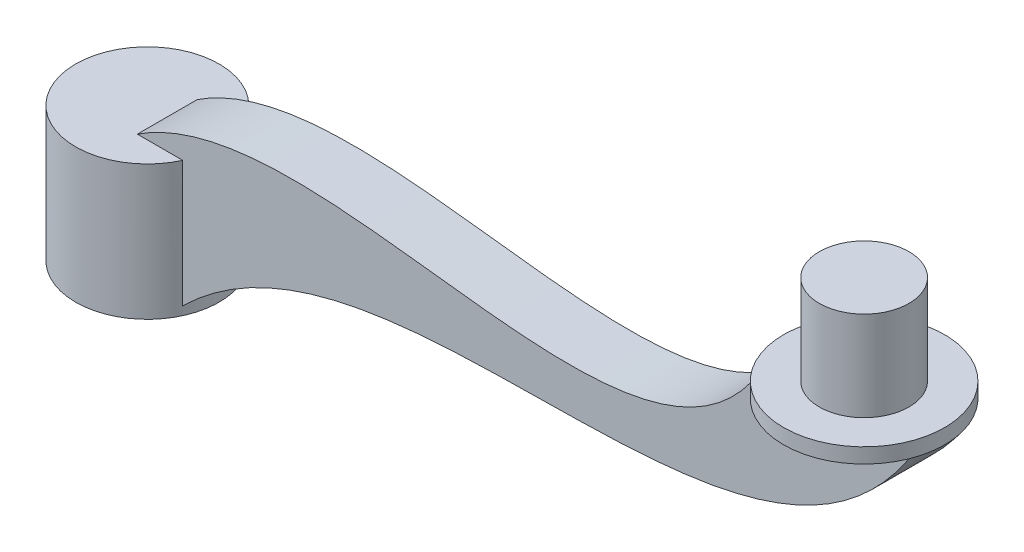
ISO-10303-21;
HEADER;
FILE_DESCRIPTION(('STEP AP214'),'2;1');
FILE_NAME('part.step','',(''),(''),'','','');
FILE_SCHEMA(('AUTOMOTIVE_DESIGN { 1 0 10303 214 1 1 1 1 }'));
ENDSEC;
DATA;
#1=APPLICATION_CONTEXT('core data for automotive mechanical design processes');
#2=APPLICATION_PROTOCOL_DEFINITION('international standard','automotive_design',2000,#1);
#3=PRODUCT_CONTEXT('',#1,'mechanical');
#4=PRODUCT('Part','Part','',(#3));
#5=PRODUCT_RELATED_PRODUCT_CATEGORY('part','',(#4));
#6=PRODUCT_DEFINITION_FORMATION('','',#4);
#7=PRODUCT_DEFINITION_CONTEXT('part definition',#1,'design');
#8=PRODUCT_DEFINITION('design','',#6,#7);
#9=PRODUCT_DEFINITION_SHAPE('','',#8);
#10=(LENGTH_UNIT() NAMED_UNIT(*) SI_UNIT(.MILLI.,.METRE.));
#11=(NAMED_UNIT(*) PLANE_ANGLE_UNIT() SI_UNIT($,.RADIAN.));
#12=(NAMED_UNIT(*) SI_UNIT($,.STERADIAN.) SOLID_ANGLE_UNIT());
#13=UNCERTAINTY_MEASURE_WITH_UNIT(LENGTH_MEASURE(1.E-05),#10,'distance_accuracy_value','');
#14=(GEOMETRIC_REPRESENTATION_CONTEXT(3) GLOBAL_UNCERTAINTY_ASSIGNED_CONTEXT((#13)) GLOBAL_UNIT_ASSIGNED_CONTEXT((#10,
#11,#12)) REPRESENTATION_CONTEXT('',''));
#15=CARTESIAN_POINT('',(0.,0.,0.));
#16=DIRECTION('',(0.,0.,1.));
#17=DIRECTION('',(1.,0.,0.));
#18=AXIS2_PLACEMENT_3D('',#15,#16,#17);
#19=CARTESIAN_POINT('',(56.7945984748159,34.1145483571935,5.));
#20=DIRECTION('',(0.,0.,1.));
#21=DIRECTION('',(1.,0.,0.));
#22=AXIS2_PLACEMENT_3D('',#19,#20,#21);
#23=PLANE('',#22);
#24=DIRECTION('',(-1.,0.,0.));
#25=VECTOR('',#24,1.);
#26=CARTESIAN_POINT('',(56.7945984748159,30.,5.));
#27=LINE('',#26,#25);
#28=CARTESIAN_POINT('',(10.9087121146357,30.,5.));
#29=VERTEX_POINT('',#28);
#30=CARTESIAN_POINT('',(3.32301425381185,30.0000000064752,5.));
#31=VERTEX_POINT('',#30);
#32=EDGE_CURVE('E204',#29,#31,#27,.T.);
#33=ORIENTED_EDGE('',*,*,#32,.F.);
#34=DIRECTION('',(0.,-1.,0.));
#35=VECTOR('',#34,1.);
#36=CARTESIAN_POINT('',(10.9087121146357,27.5,5.));
#37=LINE('',#36,#35);
#38=CARTESIAN_POINT('',(10.9087121243852,8.93672570436775,5.));
#39=VERTEX_POINT('',#38);
#40=EDGE_CURVE('E54',#39,#29,#37,.F.);
#41=ORIENTED_EDGE('',*,*,#40,.F.);
#42=CARTESIAN_POINT('',(8.96130530046107,6.91526062901725,5.));
#43=CARTESIAN_POINT('',(42.430030166571,43.6238022144115,5.));
#44=CARTESIAN_POINT('',(104.826512854306,5.89325619487997,5.));
#45=CARTESIAN_POINT('',(132.347009744007,47.5,5.));
#46=B_SPLINE_CURVE_WITH_KNOTS('',3,(#42,#43,#44,#45),.UNSPECIFIED.,.F.,.F.,(4,4),(0.,1.),.UNSPECIFIED.);
#47=CARTESIAN_POINT('',(132.347009744007,47.5,4.99999999999998));
#48=VERTEX_POINT('',#47);
#49=EDGE_CURVE('E135',#39,#48,#46,.T.);
#50=ORIENTED_EDGE('',*,*,#49,.T.);
#51=DIRECTION('',(-1.,0.,0.));
#52=VECTOR('',#51,1.);
#53=CARTESIAN_POINT('',(107.347009744007,47.5,5.));
#54=LINE('',#53,#52);
#55=CARTESIAN_POINT('',(107.347009744007,47.5,4.99999999999999));
#56=VERTEX_POINT('',#55);
#57=EDGE_CURVE('E107',#48,#56,#54,.T.);
#58=ORIENTED_EDGE('',*,*,#57,.T.);
#59=CARTESIAN_POINT('',(107.347009744007,47.5,5.));
#60=CARTESIAN_POINT('',(86.574153169107,13.5320115786208,5.));
#61=CARTESIAN_POINT('',(29.0957728490664,52.4401173738952,5.));
#62=CARTESIAN_POINT('',(0.,27.5,5.));
#63=B_SPLINE_CURVE_WITH_KNOTS('',3,(#59,#60,#61,#62),.UNSPECIFIED.,.F.,.F.,(4,4),(0.,1.),.UNSPECIFIED.);
#64=EDGE_CURVE('E218',#56,#31,#63,.T.);
#65=ORIENTED_EDGE('',*,*,#64,.T.);
#66=EDGE_LOOP('',(#33,#41,#50,#58,#65));
#67=FACE_BOUND('',#66,.T.);
#68=ADVANCED_FACE('F37',(#67),#23,.T.);
#69=CARTESIAN_POINT('',(56.7945984748159,34.1145483571935,-5.));
#70=DIRECTION('',(0.,0.,1.));
#71=DIRECTION('',(1.,0.,0.));
#72=AXIS2_PLACEMENT_3D('',#69,#70,#71);
#73=PLANE('',#72);
#74=DIRECTION('',(0.,-1.,0.));
#75=VECTOR('',#74,1.);
#76=CARTESIAN_POINT('',(10.9087121146357,27.5,-5.));
#77=LINE('',#76,#75);
#78=CARTESIAN_POINT('',(10.9087121243852,8.93672570436775,-5.));
#79=VERTEX_POINT('',#78);
#80=CARTESIAN_POINT('',(10.9087121146357,30.,-5.));
#81=VERTEX_POINT('',#80);
#82=EDGE_CURVE('E146',#79,#81,#77,.F.);
#83=ORIENTED_EDGE('',*,*,#82,.T.);
#84=DIRECTION('',(-1.,0.,0.));
#85=VECTOR('',#84,1.);
#86=CARTESIAN_POINT('',(56.7945984748159,30.,-5.));
#87=LINE('',#86,#85);
#88=CARTESIAN_POINT('',(3.32301425381185,30.0000000064752,-5.));
#89=VERTEX_POINT('',#88);
#90=EDGE_CURVE('E42',#81,#89,#87,.T.);
#91=ORIENTED_EDGE('',*,*,#90,.T.);
#92=CARTESIAN_POINT('',(107.347009744007,47.5,-5.));
#93=CARTESIAN_POINT('',(86.574153169107,13.5320115786208,-5.));
#94=CARTESIAN_POINT('',(29.0957728490664,52.4401173738952,-5.));
#95=CARTESIAN_POINT('',(0.,27.5,-5.));
#96=B_SPLINE_CURVE_WITH_KNOTS('',3,(#92,#93,#94,#95),.UNSPECIFIED.,.F.,.F.,(4,4),(0.,1.),.UNSPECIFIED.);
#97=CARTESIAN_POINT('',(107.347009744007,47.5,-5.));
#98=VERTEX_POINT('',#97);
#99=EDGE_CURVE('E199',#98,#89,#96,.T.);
#100=ORIENTED_EDGE('',*,*,#99,.F.);
#101=DIRECTION('',(-1.,0.,0.));
#102=VECTOR('',#101,1.);
#103=CARTESIAN_POINT('',(107.347009744007,47.5,-5.));
#104=LINE('',#103,#102);
#105=CARTESIAN_POINT('',(132.347009744007,47.5,-4.99999999999998));
#106=VERTEX_POINT('',#105);
#107=EDGE_CURVE('E213',#106,#98,#104,.T.);
#108=ORIENTED_EDGE('',*,*,#107,.F.);
#109=CARTESIAN_POINT('',(8.96130530046107,6.91526062901725,-5.));
#110=CARTESIAN_POINT('',(42.430030166571,43.6238022144115,-5.));
#111=CARTESIAN_POINT('',(104.826512854306,5.89325619487997,-5.));
#112=CARTESIAN_POINT('',(132.347009744007,47.5,-5.));
#113=B_SPLINE_CURVE_WITH_KNOTS('',3,(#109,#110,#111,#112),.UNSPECIFIED.,.F.,.F.,(4,4),(0.,1.),.UNSPECIFIED.);
#114=EDGE_CURVE('E141',#79,#106,#113,.T.);
#115=ORIENTED_EDGE('',*,*,#114,.F.);
#116=EDGE_LOOP('',(#83,#91,#100,#108,#115));
#117=FACE_BOUND('',#116,.T.);
#118=ADVANCED_FACE('F186',(#117),#73,.F.);
#119=DIRECTION('',(0.,0.,-1.));
#120=VECTOR('',#119,1.);
#121=SURFACE_OF_LINEAR_EXTRUSION('',#46,#120);
#122=ORIENTED_EDGE('',*,*,#49,.F.);
#123=CARTESIAN_POINT('',(10.9087121146357,8.93672569479504,5.));
#124=CARTESIAN_POINT('',(10.9750924873974,9.00190220388737,4.85518919719385));
#125=CARTESIAN_POINT('',(11.0390515291262,9.06433743322561,4.70802027712108));
#126=CARTESIAN_POINT('',(11.161772463274,9.1835449869188,4.40918401146909));
#127=CARTESIAN_POINT('',(11.2205315253605,9.24031422941745,4.25751427535224));
#128=CARTESIAN_POINT('',(11.3324333877793,9.34794621351776,3.95002942770915));
#129=CARTESIAN_POINT('',(11.3855753799982,9.39880810534778,3.79421372373853));
#130=CARTESIAN_POINT('',(11.4859525211913,9.49449997028225,3.47855820555797));
#131=CARTESIAN_POINT('',(11.5331776457461,9.53931971622271,3.31871209885348));
#132=CARTESIAN_POINT('',(11.6212702927884,9.62264024102565,2.99567945256046));
#133=CARTESIAN_POINT('',(11.6621388464231,9.661142044825,2.8324934596302));
#134=CARTESIAN_POINT('',(11.7372199519066,9.73167288072524,2.50323590255211));
#135=CARTESIAN_POINT('',(11.7714328647516,9.76370226388831,2.33716449543918));
#136=CARTESIAN_POINT('',(11.8484640117175,9.83565449841943,1.91816176132851));
#137=CARTESIAN_POINT('',(11.8869145633315,9.87140635828938,1.66368184047784));
#138=CARTESIAN_POINT('',(11.9474504580324,9.92758989348723,1.15110838815624));
#139=CARTESIAN_POINT('',(11.9695347394631,9.94802057495361,0.893014623366806));
#140=CARTESIAN_POINT('',(11.9969169765397,9.97334118452013,0.375524810011332));
#141=CARTESIAN_POINT('',(12.0022378066459,9.97825228978664,0.116131020222214));
#142=CARTESIAN_POINT('',(11.9960564130363,9.97254139387251,-0.402268305286472));
#143=CARTESIAN_POINT('',(11.9845552923721,9.96192041116447,-0.661273865348341));
#144=CARTESIAN_POINT('',(11.9457045452131,9.92595772202473,-1.16704801358765));
#145=CARTESIAN_POINT('',(11.9189771506314,9.90119387931852,-1.41390608652221));
#146=CARTESIAN_POINT('',(11.8506106054289,9.83762826894151,-1.90372829766149));
#147=CARTESIAN_POINT('',(11.8089706106376,9.79882570656738,-2.1466922146127));
#148=CARTESIAN_POINT('',(11.711446146265,9.7075193936419,-2.6271946285022));
#149=CARTESIAN_POINT('',(11.6555571055591,9.65501124618042,-2.86473135769171));
#150=CARTESIAN_POINT('',(11.5304395160974,9.53677520944826,-3.33281337071901));
#151=CARTESIAN_POINT('',(11.4612148679393,9.47105118550887,-3.56336067616218));
#152=CARTESIAN_POINT('',(11.3161054732223,9.33232910505702,-3.99931086703459));
#153=CARTESIAN_POINT('',(11.2411088295748,9.26024550136529,-4.20530319412733));
#154=CARTESIAN_POINT('',(11.081736049113,9.10596185132348,-4.60892372833974));
#155=CARTESIAN_POINT('',(10.9973891109575,9.02379321644615,-4.80657545283623));
#156=CARTESIAN_POINT('',(10.9087121146357,8.93672569479504,-5.));
#157=B_SPLINE_CURVE_WITH_KNOTS('',3,(#123,#124,#125,#126,#127,#128,#129,#130,#131,#132,#133,
#134,#135,#136,#137,#138,#139,#140,#141,#142,#143,#144,#145,#146,#147,#148,#149,#150,#151,#152,
#153,#154,#155,#156),.UNSPECIFIED.,.F.,.F.,(4,2,2,2,2,2,2,2,2,2,2,2,2,2,2,2,4),(0.,
0.516316274832384,1.03291187236282,1.54958169030603,2.06711534746016,2.58456496382459,
3.10198650633647,3.88047093407713,4.65900585654986,5.43647797302186,6.21389911125103,
6.96162108442629,7.70938539124293,8.45738988496947,9.20517592245298,9.89691281111184,
10.5865473885536),.UNSPECIFIED.);
#158=EDGE_CURVE('E171',#39,#79,#157,.T.);
#159=ORIENTED_EDGE('',*,*,#158,.T.);
#160=ORIENTED_EDGE('',*,*,#114,.T.);
#161=DIRECTION('',(0.,0.,-1.));
#162=VECTOR('',#161,1.);
#163=CARTESIAN_POINT('',(132.347009744007,47.5,5.));
#164=LINE('',#163,#162);
#165=EDGE_CURVE('E130',#48,#106,#164,.T.);
#166=ORIENTED_EDGE('',*,*,#165,.F.);
#167=EDGE_LOOP('',(#122,#159,#160,#166));
#168=FACE_BOUND('',#167,.T.);
#169=ADVANCED_FACE('F139',(#168),#121,.F.);
#170=CARTESIAN_POINT('',(0.,27.5,5.));
#171=DIRECTION('',(0.,1.,0.));
#172=DIRECTION('',(-1.,0.,0.));
#173=AXIS2_PLACEMENT_3D('',#170,#171,#172);
#174=PLANE('',#173);
#175=CARTESIAN_POINT('',(0.,27.5,0.));
#176=DIRECTION('',(0.,1.,0.));
#177=DIRECTION('',(0.,0.,1.));
#178=AXIS2_PLACEMENT_3D('',#175,#176,#177);
#179=CIRCLE('',#178,7.5005);
#180=CARTESIAN_POINT('',(0.,27.5,7.5005));
#181=VERTEX_POINT('',#180);
#182=EDGE_CURVE('E163',#181,#181,#179,.T.);
#183=ORIENTED_EDGE('',*,*,#182,.F.);
#184=EDGE_LOOP('',(#183));
#185=FACE_BOUND('',#184,.T.);
#186=ADVANCED_FACE('F234',(#185),#174,.F.);
#187=DIRECTION('',(0.,0.,-1.));
#188=VECTOR('',#187,1.);
#189=SURFACE_OF_LINEAR_EXTRUSION('',#63,#188);
#190=ORIENTED_EDGE('',*,*,#99,.T.);
#191=DIRECTION('',(0.,0.,-1.));
#192=VECTOR('',#191,1.);
#193=CARTESIAN_POINT('',(3.32301424395503,30.,5.));
#194=LINE('',#193,#192);
#195=EDGE_CURVE('E62',#89,#31,#194,.F.);
#196=ORIENTED_EDGE('',*,*,#195,.T.);
#197=ORIENTED_EDGE('',*,*,#64,.F.);
#198=DIRECTION('',(0.,0.,-1.));
#199=VECTOR('',#198,1.);
#200=CARTESIAN_POINT('',(107.347009744007,47.5,5.));
#201=LINE('',#200,#199);
#202=EDGE_CURVE('E114',#56,#98,#201,.T.);
#203=ORIENTED_EDGE('',*,*,#202,.T.);
#204=EDGE_LOOP('',(#190,#196,#197,#203));
#205=FACE_BOUND('',#204,.T.);
#206=ADVANCED_FACE('F230',(#205),#189,.F.);
#207=CARTESIAN_POINT('',(0.,7.5,0.));
#208=DIRECTION('',(0.,1.,0.));
#209=DIRECTION('',(0.,0.,1.));
#210=AXIS2_PLACEMENT_3D('',#207,#208,#209);
#211=PLANE('',#210);
#212=DIRECTION('',(0.,0.,-1.));
#213=VECTOR('',#212,1.);
#214=CARTESIAN_POINT('',(8.96130530046107,7.5,0.));
#215=LINE('',#214,#213);
#216=CARTESIAN_POINT('',(8.96130530046107,7.5,5.));
#217=VERTEX_POINT('',#216);
#218=CARTESIAN_POINT('',(8.96130530046107,7.5,-5.));
#219=VERTEX_POINT('',#218);
#220=EDGE_CURVE('E177',#217,#219,#215,.T.);
#221=ORIENTED_EDGE('',*,*,#220,.F.);
#222=DIRECTION('',(1.,0.,0.));
#223=VECTOR('',#222,1.);
#224=CARTESIAN_POINT('',(0.,7.5,5.));
#225=LINE('',#224,#223);
#226=CARTESIAN_POINT('',(9.50277291117378,7.5,5.));
#227=VERTEX_POINT('',#226);
#228=EDGE_CURVE('E157',#217,#227,#225,.T.);
#229=ORIENTED_EDGE('',*,*,#228,.T.);
#230=DIRECTION('',(0.,0.,-1.));
#231=VECTOR('',#230,1.);
#232=CARTESIAN_POINT('',(9.50277291117378,7.5,5.));
#233=LINE('',#232,#231);
#234=CARTESIAN_POINT('',(9.50277291117596,7.50000000000231,-5.));
#235=VERTEX_POINT('',#234);
#236=EDGE_CURVE('E159',#235,#227,#233,.F.);
#237=ORIENTED_EDGE('',*,*,#236,.F.);
#238=DIRECTION('',(1.,0.,0.));
#239=VECTOR('',#238,1.);
#240=CARTESIAN_POINT('',(0.,7.5,-5.));
#241=LINE('',#240,#239);
#242=EDGE_CURVE('E153',#219,#235,#241,.T.);
#243=ORIENTED_EDGE('',*,*,#242,.F.);
#244=EDGE_LOOP('',(#221,#229,#237,#243));
#245=FACE_BOUND('',#244,.T.);
#246=CARTESIAN_POINT('',(0.,7.5,0.));
#247=DIRECTION('',(0.,1.,0.));
#248=DIRECTION('',(0.,0.,1.));
#249=AXIS2_PLACEMENT_3D('',#246,#247,#248);
#250=CIRCLE('',#249,12.);
#251=CARTESIAN_POINT('',(0.,7.5,12.));
#252=VERTEX_POINT('',#251);
#253=EDGE_CURVE('E166',#252,#252,#250,.T.);
#254=ORIENTED_EDGE('',*,*,#253,.F.);
#255=EDGE_LOOP('',(#254));
#256=FACE_BOUND('',#255,.T.);
#257=CARTESIAN_POINT('',(0.,7.5,0.));
#258=DIRECTION('',(0.,1.,0.));
#259=DIRECTION('',(0.,0.,1.));
#260=AXIS2_PLACEMENT_3D('',#257,#258,#259);
#261=CIRCLE('',#260,7.5005);
#262=CARTESIAN_POINT('',(0.,7.5,7.5005));
#263=VERTEX_POINT('',#262);
#264=EDGE_CURVE('E162',#263,#263,#261,.T.);
#265=ORIENTED_EDGE('',*,*,#264,.T.);
#266=EDGE_LOOP('',(#265));
#267=FACE_BOUND('',#266,.T.);
#268=ADVANCED_FACE('F233',(#245,#256,#267),#211,.F.);
#269=CARTESIAN_POINT('',(0.,27.5,0.));
#270=DIRECTION('',(0.,-1.,0.));
#271=DIRECTION('',(0.,0.,-1.));
#272=AXIS2_PLACEMENT_3D('',#269,#270,#271);
#273=CYLINDRICAL_SURFACE('',#272,12.);
#274=ORIENTED_EDGE('',*,*,#158,.F.);
#275=ORIENTED_EDGE('',*,*,#40,.T.);
#276=CARTESIAN_POINT('',(0.,30.,0.));
#277=DIRECTION('',(0.,1.,0.));
#278=DIRECTION('',(0.,0.,1.));
#279=AXIS2_PLACEMENT_3D('',#276,#277,#278);
#280=CIRCLE('',#279,12.);
#281=EDGE_CURVE('E271',#81,#29,#280,.T.);
#282=ORIENTED_EDGE('',*,*,#281,.F.);
#283=ORIENTED_EDGE('',*,*,#82,.F.);
#284=EDGE_LOOP('',(#274,#275,#282,#283));
#285=FACE_BOUND('',#284,.T.);
#286=ORIENTED_EDGE('',*,*,#253,.T.);
#287=EDGE_LOOP('',(#286));
#288=FACE_BOUND('',#287,.T.);
#289=ADVANCED_FACE('F39',(#285,#288),#273,.T.);
#290=CARTESIAN_POINT('',(0.,27.5,0.));
#291=DIRECTION('',(0.,-1.,0.));
#292=DIRECTION('',(0.,0.,-1.));
#293=AXIS2_PLACEMENT_3D('',#290,#291,#292);
#294=CYLINDRICAL_SURFACE('',#293,7.5005);
#295=ORIENTED_EDGE('',*,*,#182,.T.);
#296=EDGE_LOOP('',(#295));
#297=FACE_BOUND('',#296,.T.);
#298=ORIENTED_EDGE('',*,*,#264,.F.);
#299=EDGE_LOOP('',(#298));
#300=FACE_BOUND('',#299,.T.);
#301=ADVANCED_FACE('F235',(#297,#300),#294,.F.);
#302=ORIENTED_EDGE('',*,*,#228,.F.);
#303=DIRECTION('',(0.,-1.,0.));
#304=VECTOR('',#303,1.);
#305=CARTESIAN_POINT('',(8.96130530046107,27.5,5.));
#306=LINE('',#305,#304);
#307=CARTESIAN_POINT('',(8.96130530046107,6.91526062901725,5.));
#308=VERTEX_POINT('',#307);
#309=EDGE_CURVE('E137',#217,#308,#306,.T.);
#310=ORIENTED_EDGE('',*,*,#309,.T.);
#311=EDGE_CURVE('E115',#308,#227,#46,.T.);
#312=ORIENTED_EDGE('',*,*,#311,.T.);
#313=EDGE_LOOP('',(#302,#310,#312));
#314=FACE_BOUND('',#313,.T.);
#315=ADVANCED_FACE('F237',(#314),#23,.T.);
#316=DIRECTION('',(0.,-1.,0.));
#317=VECTOR('',#316,1.);
#318=CARTESIAN_POINT('',(8.96130530046107,27.5,-5.));
#319=LINE('',#318,#317);
#320=CARTESIAN_POINT('',(8.96130530046107,6.91526062901725,-5.));
#321=VERTEX_POINT('',#320);
#322=EDGE_CURVE('E203',#219,#321,#319,.T.);
#323=ORIENTED_EDGE('',*,*,#322,.F.);
#324=ORIENTED_EDGE('',*,*,#242,.T.);
#325=EDGE_CURVE('E209',#321,#235,#113,.T.);
#326=ORIENTED_EDGE('',*,*,#325,.F.);
#327=EDGE_LOOP('',(#323,#324,#326));
#328=FACE_BOUND('',#327,.T.);
#329=ADVANCED_FACE('F184',(#328),#73,.F.);
#330=ORIENTED_EDGE('',*,*,#325,.T.);
#331=ORIENTED_EDGE('',*,*,#236,.T.);
#332=ORIENTED_EDGE('',*,*,#311,.F.);
#333=DIRECTION('',(0.,0.,-1.));
#334=VECTOR('',#333,1.);
#335=CARTESIAN_POINT('',(8.96130530046107,6.91526062901725,5.));
#336=LINE('',#335,#334);
#337=EDGE_CURVE('E143',#308,#321,#336,.T.);
#338=ORIENTED_EDGE('',*,*,#337,.T.);
#339=EDGE_LOOP('',(#330,#331,#332,#338));
#340=FACE_BOUND('',#339,.T.);
#341=ADVANCED_FACE('F178',(#340),#121,.F.);
#342=CARTESIAN_POINT('',(8.96130530046107,27.5,5.));
#343=DIRECTION('',(1.,0.,0.));
#344=DIRECTION('',(0.,1.,0.));
#345=AXIS2_PLACEMENT_3D('',#342,#343,#344);
#346=PLANE('',#345);
#347=ORIENTED_EDGE('',*,*,#309,.F.);
#348=ORIENTED_EDGE('',*,*,#220,.T.);
#349=ORIENTED_EDGE('',*,*,#322,.T.);
#350=ORIENTED_EDGE('',*,*,#337,.F.);
#351=EDGE_LOOP('',(#347,#348,#349,#350));
#352=FACE_BOUND('',#351,.T.);
#353=ADVANCED_FACE('F183',(#352),#346,.F.);
#354=CARTESIAN_POINT('',(0.,30.,0.));
#355=DIRECTION('',(0.,1.,0.));
#356=DIRECTION('',(0.,0.,1.));
#357=AXIS2_PLACEMENT_3D('',#354,#355,#356);
#358=PLANE('',#357);
#359=ORIENTED_EDGE('',*,*,#281,.T.);
#360=ORIENTED_EDGE('',*,*,#32,.T.);
#361=ORIENTED_EDGE('',*,*,#195,.F.);
#362=ORIENTED_EDGE('',*,*,#90,.F.);
#363=EDGE_LOOP('',(#359,#360,#361,#362));
#364=FACE_BOUND('',#363,.T.);
#365=ADVANCED_FACE('F270',(#364),#358,.T.);
#366=CARTESIAN_POINT('',(119.847009744007,47.5,0.));
#367=DIRECTION('',(0.,1.,0.));
#368=DIRECTION('',(0.,0.,1.));
#369=AXIS2_PLACEMENT_3D('',#366,#367,#368);
#370=PLANE('',#369);
#371=CARTESIAN_POINT('',(119.847009744007,47.5,0.));
#372=DIRECTION('',(0.,1.,0.));
#373=DIRECTION('',(0.,0.,1.));
#374=AXIS2_PLACEMENT_3D('',#371,#372,#373);
#375=CIRCLE('',#374,13.4629120178363);
#376=EDGE_CURVE('E121',#48,#106,#375,.T.);
#377=ORIENTED_EDGE('',*,*,#376,.F.);
#378=ORIENTED_EDGE('',*,*,#165,.T.);
#379=EDGE_LOOP('',(#377,#378));
#380=FACE_BOUND('',#379,.T.);
#381=ADVANCED_FACE('F128',(#380),#370,.F.);
#382=EDGE_CURVE('E133',#106,#98,#375,.T.);
#383=ORIENTED_EDGE('',*,*,#382,.F.);
#384=ORIENTED_EDGE('',*,*,#107,.T.);
#385=EDGE_LOOP('',(#383,#384));
#386=FACE_BOUND('',#385,.T.);
#387=ADVANCED_FACE('F299',(#386),#370,.F.);
#388=EDGE_CURVE('E124',#98,#56,#375,.T.);
#389=ORIENTED_EDGE('',*,*,#388,.F.);
#390=ORIENTED_EDGE('',*,*,#202,.F.);
#391=EDGE_LOOP('',(#389,#390));
#392=FACE_BOUND('',#391,.T.);
#393=ADVANCED_FACE('F294',(#392),#370,.F.);
#394=CARTESIAN_POINT('',(119.847009744007,50.,0.));
#395=DIRECTION('',(0.,-1.,0.));
#396=DIRECTION('',(0.,0.,-1.));
#397=AXIS2_PLACEMENT_3D('',#394,#395,#396);
#398=CYLINDRICAL_SURFACE('',#397,13.4629120178363);
#399=CARTESIAN_POINT('',(119.847009744007,50.,0.));
#400=DIRECTION('',(0.,1.,0.));
#401=DIRECTION('',(0.,0.,1.));
#402=AXIS2_PLACEMENT_3D('',#399,#400,#401);
#403=CIRCLE('',#402,13.4629120178363);
#404=CARTESIAN_POINT('',(119.847009744007,50.,13.4629120178363));
#405=VERTEX_POINT('',#404);
#406=EDGE_CURVE('E132',#405,#405,#403,.T.);
#407=ORIENTED_EDGE('',*,*,#406,.F.);
#408=EDGE_LOOP('',(#407));
#409=FACE_BOUND('',#408,.T.);
#410=ORIENTED_EDGE('',*,*,#376,.T.);
#411=ORIENTED_EDGE('',*,*,#382,.T.);
#412=ORIENTED_EDGE('',*,*,#388,.T.);
#413=EDGE_CURVE('E110',#56,#48,#375,.T.);
#414=ORIENTED_EDGE('',*,*,#413,.T.);
#415=EDGE_LOOP('',(#410,#411,#412,#414));
#416=FACE_BOUND('',#415,.T.);
#417=ADVANCED_FACE('F120',(#409,#416),#398,.T.);
#418=CARTESIAN_POINT('',(119.847009744007,50.,0.));
#419=DIRECTION('',(0.,1.,0.));
#420=DIRECTION('',(0.,0.,1.));
#421=AXIS2_PLACEMENT_3D('',#418,#419,#420);
#422=PLANE('',#421);
#423=CARTESIAN_POINT('',(119.847009744007,50.,0.));
#424=DIRECTION('',(0.,1.,0.));
#425=DIRECTION('',(0.,0.,1.));
#426=AXIS2_PLACEMENT_3D('',#423,#424,#425);
#427=CIRCLE('',#426,7.5);
#428=CARTESIAN_POINT('',(119.847009744007,50.,7.5));
#429=VERTEX_POINT('',#428);
#430=EDGE_CURVE('E11',#429,#429,#427,.T.);
#431=ORIENTED_EDGE('',*,*,#430,.F.);
#432=EDGE_LOOP('',(#431));
#433=FACE_BOUND('',#432,.T.);
#434=ORIENTED_EDGE('',*,*,#406,.T.);
#435=EDGE_LOOP('',(#434));
#436=FACE_BOUND('',#435,.T.);
#437=ADVANCED_FACE('F287',(#433,#436),#422,.T.);
#438=ORIENTED_EDGE('',*,*,#57,.F.);
#439=ORIENTED_EDGE('',*,*,#413,.F.);
#440=EDGE_LOOP('',(#438,#439));
#441=FACE_BOUND('',#440,.T.);
#442=ADVANCED_FACE('F109',(#441),#370,.F.);
#443=CARTESIAN_POINT('',(119.847009744007,65.,0.));
#444=DIRECTION('',(0.,-1.,0.));
#445=DIRECTION('',(0.,0.,-1.));
#446=AXIS2_PLACEMENT_3D('',#443,#444,#445);
#447=CYLINDRICAL_SURFACE('',#446,7.5);
#448=CARTESIAN_POINT('',(119.847009744007,65.,0.));
#449=DIRECTION('',(0.,1.,0.));
#450=DIRECTION('',(0.,0.,1.));
#451=AXIS2_PLACEMENT_3D('',#448,#449,#450);
#452=CIRCLE('',#451,7.5);
#453=CARTESIAN_POINT('',(119.847009744007,65.,7.5));
#454=VERTEX_POINT('',#453);
#455=EDGE_CURVE('E125',#454,#454,#452,.T.);
#456=ORIENTED_EDGE('',*,*,#455,.F.);
#457=EDGE_LOOP('',(#456));
#458=FACE_BOUND('',#457,.T.);
#459=ORIENTED_EDGE('',*,*,#430,.T.);
#460=EDGE_LOOP('',(#459));
#461=FACE_BOUND('',#460,.T.);
#462=ADVANCED_FACE('F281',(#458,#461),#447,.T.);
#463=CARTESIAN_POINT('',(119.847009744007,65.,0.));
#464=DIRECTION('',(0.,1.,0.));
#465=DIRECTION('',(0.,0.,1.));
#466=AXIS2_PLACEMENT_3D('',#463,#464,#465);
#467=PLANE('',#466);
#468=ORIENTED_EDGE('',*,*,#455,.T.);
#469=EDGE_LOOP('',(#468));
#470=FACE_BOUND('',#469,.T.);
#471=ADVANCED_FACE('F279',(#470),#467,.T.);
#472=CLOSED_SHELL('',(#68,#118,#169,#186,#206,#268,#289,#301,#315,#329,#341,#353,#365,#381,#387,
#393,#417,#437,#442,#462,#471));
#473=MANIFOLD_SOLID_BREP('B2',#472);
#474=ADVANCED_BREP_SHAPE_REPRESENTATION('',(#18,#473),#14);
#475=SHAPE_DEFINITION_REPRESENTATION(#9,#474);
ENDSEC;
END-ISO-10303-21;
